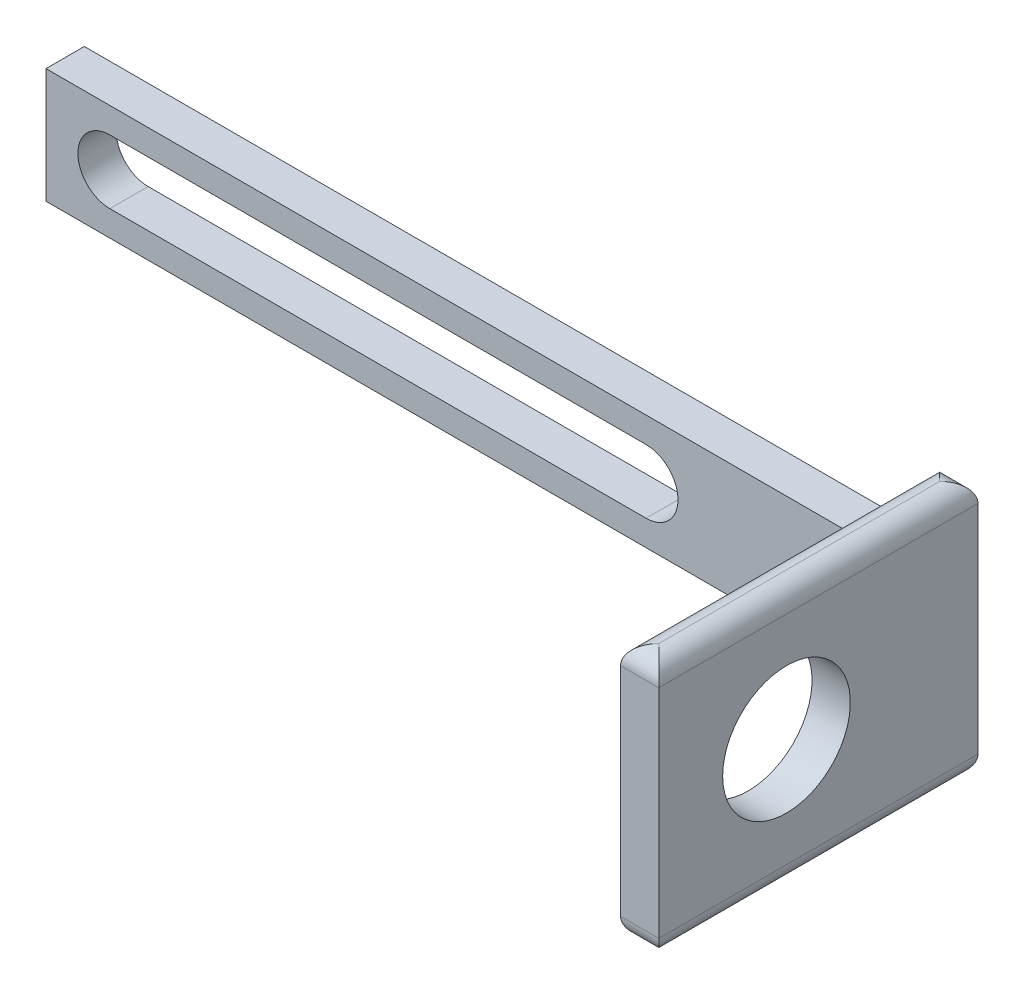
ISO-10303-21;
HEADER;
FILE_DESCRIPTION(('STEP AP214'),'2;1');
FILE_NAME('part.step','',(''),(''),'','','');
FILE_SCHEMA(('AUTOMOTIVE_DESIGN { 1 0 10303 214 1 1 1 1 }'));
ENDSEC;
DATA;
#1=APPLICATION_CONTEXT('core data for automotive mechanical design processes');
#2=APPLICATION_PROTOCOL_DEFINITION('international standard','automotive_design',2000,#1);
#3=PRODUCT_CONTEXT('',#1,'mechanical');
#4=PRODUCT('Part','Part','',(#3));
#5=PRODUCT_RELATED_PRODUCT_CATEGORY('part','',(#4));
#6=PRODUCT_DEFINITION_FORMATION('','',#4);
#7=PRODUCT_DEFINITION_CONTEXT('part definition',#1,'design');
#8=PRODUCT_DEFINITION('design','',#6,#7);
#9=PRODUCT_DEFINITION_SHAPE('','',#8);
#10=(LENGTH_UNIT() NAMED_UNIT(*) SI_UNIT(.MILLI.,.METRE.));
#11=(NAMED_UNIT(*) PLANE_ANGLE_UNIT() SI_UNIT($,.RADIAN.));
#12=(NAMED_UNIT(*) SI_UNIT($,.STERADIAN.) SOLID_ANGLE_UNIT());
#13=UNCERTAINTY_MEASURE_WITH_UNIT(LENGTH_MEASURE(1.E-05),#10,'distance_accuracy_value','');
#14=(GEOMETRIC_REPRESENTATION_CONTEXT(3) GLOBAL_UNCERTAINTY_ASSIGNED_CONTEXT((#13)) GLOBAL_UNIT_ASSIGNED_CONTEXT((#10,
#11,#12)) REPRESENTATION_CONTEXT('',''));
#15=CARTESIAN_POINT('',(0.,0.,0.));
#16=DIRECTION('',(0.,0.,1.));
#17=DIRECTION('',(1.,0.,0.));
#18=AXIS2_PLACEMENT_3D('',#15,#16,#17);
#19=CARTESIAN_POINT('',(35.,-4.5,3.));
#20=DIRECTION('',(0.,0.,1.));
#21=DIRECTION('',(1.,0.,0.));
#22=AXIS2_PLACEMENT_3D('',#19,#20,#21);
#23=PLANE('',#22);
#24=CARTESIAN_POINT('',(12.0000000000001,0.,3.));
#25=DIRECTION('',(0.,0.,1.));
#26=DIRECTION('',(1.,0.,0.));
#27=AXIS2_PLACEMENT_3D('',#24,#25,#26);
#28=CIRCLE('',#27,2.5);
#29=CARTESIAN_POINT('',(12.0000000000001,-2.5,3.));
#30=VERTEX_POINT('',#29);
#31=CARTESIAN_POINT('',(12.0000000000001,2.5,3.));
#32=VERTEX_POINT('',#31);
#33=EDGE_CURVE('E219',#30,#32,#28,.T.);
#34=ORIENTED_EDGE('',*,*,#33,.F.);
#35=DIRECTION('',(1.,0.,0.));
#36=VECTOR('',#35,1.);
#37=CARTESIAN_POINT('',(12.0000000000001,-2.5,3.));
#38=LINE('',#37,#36);
#39=CARTESIAN_POINT('',(-30.,-2.5,3.));
#40=VERTEX_POINT('',#39);
#41=EDGE_CURVE('E203',#40,#30,#38,.T.);
#42=ORIENTED_EDGE('',*,*,#41,.F.);
#43=CARTESIAN_POINT('',(-30.,0.,3.));
#44=DIRECTION('',(0.,0.,1.));
#45=DIRECTION('',(1.,0.,0.));
#46=AXIS2_PLACEMENT_3D('',#43,#44,#45);
#47=CIRCLE('',#46,2.5);
#48=CARTESIAN_POINT('',(-30.,2.5,3.));
#49=VERTEX_POINT('',#48);
#50=EDGE_CURVE('E213',#49,#40,#47,.T.);
#51=ORIENTED_EDGE('',*,*,#50,.F.);
#52=DIRECTION('',(-1.,0.,0.));
#53=VECTOR('',#52,1.);
#54=CARTESIAN_POINT('',(12.0000000000001,2.5,3.));
#55=LINE('',#54,#53);
#56=EDGE_CURVE('E216',#32,#49,#55,.T.);
#57=ORIENTED_EDGE('',*,*,#56,.F.);
#58=EDGE_LOOP('',(#34,#42,#51,#57));
#59=FACE_BOUND('',#58,.T.);
#60=DIRECTION('',(1.,0.,0.));
#61=VECTOR('',#60,1.);
#62=CARTESIAN_POINT('',(-35.,-4.5,3.));
#63=LINE('',#62,#61);
#64=CARTESIAN_POINT('',(-35.,-4.5,3.));
#65=VERTEX_POINT('',#64);
#66=CARTESIAN_POINT('',(30.0000000000001,-4.5,3.));
#67=VERTEX_POINT('',#66);
#68=EDGE_CURVE('E159',#65,#67,#63,.T.);
#69=ORIENTED_EDGE('',*,*,#68,.T.);
#70=DIRECTION('',(0.,1.,0.));
#71=VECTOR('',#70,1.);
#72=CARTESIAN_POINT('',(30.0000000000001,-4.5,3.));
#73=LINE('',#72,#71);
#74=CARTESIAN_POINT('',(30.0000000000001,4.5,3.));
#75=VERTEX_POINT('',#74);
#76=EDGE_CURVE('E150',#67,#75,#73,.T.);
#77=ORIENTED_EDGE('',*,*,#76,.T.);
#78=DIRECTION('',(-1.,0.,0.));
#79=VECTOR('',#78,1.);
#80=CARTESIAN_POINT('',(-35.,4.5,3.));
#81=LINE('',#80,#79);
#82=CARTESIAN_POINT('',(-35.,4.5,3.));
#83=VERTEX_POINT('',#82);
#84=EDGE_CURVE('E163',#75,#83,#81,.T.);
#85=ORIENTED_EDGE('',*,*,#84,.T.);
#86=DIRECTION('',(0.,-1.,0.));
#87=VECTOR('',#86,1.);
#88=CARTESIAN_POINT('',(-35.,4.5,3.));
#89=LINE('',#88,#87);
#90=EDGE_CURVE('E175',#83,#65,#89,.T.);
#91=ORIENTED_EDGE('',*,*,#90,.T.);
#92=EDGE_LOOP('',(#69,#77,#85,#91));
#93=FACE_BOUND('',#92,.T.);
#94=ADVANCED_FACE('F33',(#59,#93),#23,.T.);
#95=CARTESIAN_POINT('',(-35.,4.5,3.));
#96=DIRECTION('',(0.,-1.,0.));
#97=DIRECTION('',(0.,0.,-1.));
#98=AXIS2_PLACEMENT_3D('',#95,#96,#97);
#99=PLANE('',#98);
#100=ORIENTED_EDGE('',*,*,#84,.F.);
#101=DIRECTION('',(0.,0.,1.));
#102=VECTOR('',#101,1.);
#103=CARTESIAN_POINT('',(30.0000000000001,4.5,0.));
#104=LINE('',#103,#102);
#105=CARTESIAN_POINT('',(30.0000000000001,4.5,0.));
#106=VERTEX_POINT('',#105);
#107=EDGE_CURVE('E135',#75,#106,#104,.F.);
#108=ORIENTED_EDGE('',*,*,#107,.T.);
#109=DIRECTION('',(-1.,0.,0.));
#110=VECTOR('',#109,1.);
#111=CARTESIAN_POINT('',(-35.,4.5,0.));
#112=LINE('',#111,#110);
#113=CARTESIAN_POINT('',(-35.,4.5,0.));
#114=VERTEX_POINT('',#113);
#115=EDGE_CURVE('E167',#106,#114,#112,.T.);
#116=ORIENTED_EDGE('',*,*,#115,.T.);
#117=DIRECTION('',(0.,0.,-1.));
#118=VECTOR('',#117,1.);
#119=CARTESIAN_POINT('',(-35.,4.5,3.));
#120=LINE('',#119,#118);
#121=EDGE_CURVE('E153',#83,#114,#120,.T.);
#122=ORIENTED_EDGE('',*,*,#121,.F.);
#123=EDGE_LOOP('',(#100,#108,#116,#122));
#124=FACE_BOUND('',#123,.T.);
#125=ADVANCED_FACE('F328',(#124),#99,.F.);
#126=CARTESIAN_POINT('',(-35.,-4.5,3.));
#127=DIRECTION('',(0.,1.,0.));
#128=DIRECTION('',(0.,0.,1.));
#129=AXIS2_PLACEMENT_3D('',#126,#127,#128);
#130=PLANE('',#129);
#131=DIRECTION('',(1.,0.,0.));
#132=VECTOR('',#131,1.);
#133=CARTESIAN_POINT('',(-35.,-4.5,0.));
#134=LINE('',#133,#132);
#135=CARTESIAN_POINT('',(-35.,-4.5,0.));
#136=VERTEX_POINT('',#135);
#137=CARTESIAN_POINT('',(30.0000000000001,-4.5,0.));
#138=VERTEX_POINT('',#137);
#139=EDGE_CURVE('E160',#136,#138,#134,.T.);
#140=ORIENTED_EDGE('',*,*,#139,.T.);
#141=DIRECTION('',(0.,0.,-1.));
#142=VECTOR('',#141,1.);
#143=CARTESIAN_POINT('',(30.0000000000001,-4.5,5.));
#144=LINE('',#143,#142);
#145=EDGE_CURVE('E138',#138,#67,#144,.F.);
#146=ORIENTED_EDGE('',*,*,#145,.T.);
#147=ORIENTED_EDGE('',*,*,#68,.F.);
#148=DIRECTION('',(0.,0.,-1.));
#149=VECTOR('',#148,1.);
#150=CARTESIAN_POINT('',(-35.,-4.5,3.));
#151=LINE('',#150,#149);
#152=EDGE_CURVE('E156',#65,#136,#151,.T.);
#153=ORIENTED_EDGE('',*,*,#152,.T.);
#154=EDGE_LOOP('',(#140,#146,#147,#153));
#155=FACE_BOUND('',#154,.T.);
#156=ADVANCED_FACE('F319',(#155),#130,.F.);
#157=CARTESIAN_POINT('',(35.,4.5,3.));
#158=DIRECTION('',(-1.,0.,0.));
#159=DIRECTION('',(0.,0.,1.));
#160=AXIS2_PLACEMENT_3D('',#157,#158,#159);
#161=PLANE('',#160);
#162=CARTESIAN_POINT('',(35.,0.,15.));
#163=DIRECTION('',(-1.,0.,0.));
#164=DIRECTION('',(0.,0.,1.));
#165=AXIS2_PLACEMENT_3D('',#162,#163,#164);
#166=CIRCLE('',#165,5.);
#167=CARTESIAN_POINT('',(35.,0.,20.));
#168=VERTEX_POINT('',#167);
#169=EDGE_CURVE('E189',#168,#168,#166,.F.);
#170=ORIENTED_EDGE('',*,*,#169,.F.);
#171=EDGE_LOOP('',(#170));
#172=FACE_BOUND('',#171,.T.);
#173=DIRECTION('',(0.,1.,0.));
#174=VECTOR('',#173,1.);
#175=CARTESIAN_POINT('',(35.0000000000001,-10.,25.));
#176=LINE('',#175,#174);
#177=CARTESIAN_POINT('',(35.0000000000001,-8.5,25.));
#178=VERTEX_POINT('',#177);
#179=CARTESIAN_POINT('',(35.0000000000001,8.5,25.));
#180=VERTEX_POINT('',#179);
#181=EDGE_CURVE('E186',#178,#180,#176,.T.);
#182=ORIENTED_EDGE('',*,*,#181,.F.);
#183=DIRECTION('',(0.,0.,-1.));
#184=VECTOR('',#183,1.);
#185=CARTESIAN_POINT('',(35.,-8.5,3.));
#186=LINE('',#185,#184);
#187=CARTESIAN_POINT('',(35.,-8.5,0.));
#188=VERTEX_POINT('',#187);
#189=EDGE_CURVE('E110',#178,#188,#186,.T.);
#190=ORIENTED_EDGE('',*,*,#189,.T.);
#191=DIRECTION('',(0.,1.,0.));
#192=VECTOR('',#191,1.);
#193=CARTESIAN_POINT('',(35.,4.5,0.));
#194=LINE('',#193,#192);
#195=CARTESIAN_POINT('',(35.,8.5,0.));
#196=VERTEX_POINT('',#195);
#197=EDGE_CURVE('E170',#188,#196,#194,.T.);
#198=ORIENTED_EDGE('',*,*,#197,.T.);
#199=DIRECTION('',(0.,0.,-1.));
#200=VECTOR('',#199,1.);
#201=CARTESIAN_POINT('',(35.,8.5,3.));
#202=LINE('',#201,#200);
#203=EDGE_CURVE('E78',#196,#180,#202,.F.);
#204=ORIENTED_EDGE('',*,*,#203,.T.);
#205=EDGE_LOOP('',(#182,#190,#198,#204));
#206=FACE_BOUND('',#205,.T.);
#207=ADVANCED_FACE('F345',(#172,#206),#161,.F.);
#208=CARTESIAN_POINT('',(-35.,4.5,3.));
#209=DIRECTION('',(1.,0.,0.));
#210=DIRECTION('',(0.,0.,-1.));
#211=AXIS2_PLACEMENT_3D('',#208,#209,#210);
#212=PLANE('',#211);
#213=DIRECTION('',(0.,-1.,0.));
#214=VECTOR('',#213,1.);
#215=CARTESIAN_POINT('',(-35.,4.5,0.));
#216=LINE('',#215,#214);
#217=EDGE_CURVE('E164',#114,#136,#216,.T.);
#218=ORIENTED_EDGE('',*,*,#217,.T.);
#219=ORIENTED_EDGE('',*,*,#152,.F.);
#220=ORIENTED_EDGE('',*,*,#90,.F.);
#221=ORIENTED_EDGE('',*,*,#121,.T.);
#222=EDGE_LOOP('',(#218,#219,#220,#221));
#223=FACE_BOUND('',#222,.T.);
#224=ADVANCED_FACE('F324',(#223),#212,.F.);
#225=CARTESIAN_POINT('',(35.,-4.5,0.));
#226=DIRECTION('',(0.,0.,1.));
#227=DIRECTION('',(1.,0.,0.));
#228=AXIS2_PLACEMENT_3D('',#225,#226,#227);
#229=PLANE('',#228);
#230=DIRECTION('',(-1.,0.,0.));
#231=VECTOR('',#230,1.);
#232=CARTESIAN_POINT('',(12.0000000000001,-2.5,0.));
#233=LINE('',#232,#231);
#234=CARTESIAN_POINT('',(12.0000000000001,-2.5,0.));
#235=VERTEX_POINT('',#234);
#236=CARTESIAN_POINT('',(-30.,-2.5,0.));
#237=VERTEX_POINT('',#236);
#238=EDGE_CURVE('E225',#235,#237,#233,.T.);
#239=ORIENTED_EDGE('',*,*,#238,.F.);
#240=CARTESIAN_POINT('',(12.0000000000001,0.,0.));
#241=DIRECTION('',(0.,0.,1.));
#242=DIRECTION('',(1.,0.,0.));
#243=AXIS2_PLACEMENT_3D('',#240,#241,#242);
#244=CIRCLE('',#243,2.5);
#245=CARTESIAN_POINT('',(12.0000000000001,2.5,0.));
#246=VERTEX_POINT('',#245);
#247=EDGE_CURVE('E222',#246,#235,#244,.F.);
#248=ORIENTED_EDGE('',*,*,#247,.F.);
#249=DIRECTION('',(1.,0.,0.));
#250=VECTOR('',#249,1.);
#251=CARTESIAN_POINT('',(12.0000000000001,2.5,0.));
#252=LINE('',#251,#250);
#253=CARTESIAN_POINT('',(-30.,2.5,0.));
#254=VERTEX_POINT('',#253);
#255=EDGE_CURVE('E195',#254,#246,#252,.T.);
#256=ORIENTED_EDGE('',*,*,#255,.F.);
#257=CARTESIAN_POINT('',(-30.,0.,0.));
#258=DIRECTION('',(0.,0.,1.));
#259=DIRECTION('',(1.,0.,0.));
#260=AXIS2_PLACEMENT_3D('',#257,#258,#259);
#261=CIRCLE('',#260,2.5);
#262=EDGE_CURVE('E96',#237,#254,#261,.F.);
#263=ORIENTED_EDGE('',*,*,#262,.F.);
#264=EDGE_LOOP('',(#239,#248,#256,#263));
#265=FACE_BOUND('',#264,.T.);
#266=DIRECTION('',(0.,-1.,0.));
#267=VECTOR('',#266,1.);
#268=CARTESIAN_POINT('',(32.0000000000001,-10.,0.));
#269=LINE('',#268,#267);
#270=CARTESIAN_POINT('',(32.0000000000001,8.5,0.));
#271=VERTEX_POINT('',#270);
#272=CARTESIAN_POINT('',(32.0000000000001,6.5,0.));
#273=VERTEX_POINT('',#272);
#274=EDGE_CURVE('E172',#271,#273,#269,.T.);
#275=ORIENTED_EDGE('',*,*,#274,.F.);
#276=DIRECTION('',(-1.,0.,0.));
#277=VECTOR('',#276,1.);
#278=CARTESIAN_POINT('',(35.,8.5,0.));
#279=LINE('',#278,#277);
#280=EDGE_CURVE('E52',#271,#196,#279,.F.);
#281=ORIENTED_EDGE('',*,*,#280,.T.);
#282=ORIENTED_EDGE('',*,*,#197,.F.);
#283=DIRECTION('',(1.,0.,0.));
#284=VECTOR('',#283,1.);
#285=CARTESIAN_POINT('',(35.,-8.5,0.));
#286=LINE('',#285,#284);
#287=CARTESIAN_POINT('',(32.0000000000001,-8.5,0.));
#288=VERTEX_POINT('',#287);
#289=EDGE_CURVE('E114',#188,#288,#286,.F.);
#290=ORIENTED_EDGE('',*,*,#289,.T.);
#291=CARTESIAN_POINT('',(32.0000000000001,-6.5,0.));
#292=VERTEX_POINT('',#291);
#293=EDGE_CURVE('E182',#292,#288,#269,.T.);
#294=ORIENTED_EDGE('',*,*,#293,.F.);
#295=CARTESIAN_POINT('',(30.0000000000001,-6.5,0.));
#296=DIRECTION('',(0.,0.,1.));
#297=DIRECTION('',(1.,0.,0.));
#298=AXIS2_PLACEMENT_3D('',#295,#296,#297);
#299=CIRCLE('',#298,2.);
#300=EDGE_CURVE('E132',#292,#138,#299,.T.);
#301=ORIENTED_EDGE('',*,*,#300,.T.);
#302=ORIENTED_EDGE('',*,*,#139,.F.);
#303=ORIENTED_EDGE('',*,*,#217,.F.);
#304=ORIENTED_EDGE('',*,*,#115,.F.);
#305=CARTESIAN_POINT('',(30.0000000000001,6.5,0.));
#306=DIRECTION('',(0.,0.,1.));
#307=DIRECTION('',(1.,0.,0.));
#308=AXIS2_PLACEMENT_3D('',#305,#306,#307);
#309=CIRCLE('',#308,2.);
#310=EDGE_CURVE('E123',#106,#273,#309,.T.);
#311=ORIENTED_EDGE('',*,*,#310,.T.);
#312=EDGE_LOOP('',(#275,#281,#282,#290,#294,#301,#302,#303,#304,#311));
#313=FACE_BOUND('',#312,.T.);
#314=ADVANCED_FACE('F248',(#265,#313),#229,.F.);
#315=CARTESIAN_POINT('',(32.0000000000001,-10.,3.));
#316=DIRECTION('',(1.,0.,0.));
#317=DIRECTION('',(0.,0.,-1.));
#318=AXIS2_PLACEMENT_3D('',#315,#316,#317);
#319=PLANE('',#318);
#320=CARTESIAN_POINT('',(32.0000000000001,0.,15.));
#321=DIRECTION('',(-1.,0.,0.));
#322=DIRECTION('',(0.,0.,1.));
#323=AXIS2_PLACEMENT_3D('',#320,#321,#322);
#324=CIRCLE('',#323,5.);
#325=CARTESIAN_POINT('',(32.0000000000001,0.,20.));
#326=VERTEX_POINT('',#325);
#327=EDGE_CURVE('E192',#326,#326,#324,.T.);
#328=ORIENTED_EDGE('',*,*,#327,.F.);
#329=EDGE_LOOP('',(#328));
#330=FACE_BOUND('',#329,.T.);
#331=ORIENTED_EDGE('',*,*,#293,.T.);
#332=DIRECTION('',(0.,0.,-1.));
#333=VECTOR('',#332,1.);
#334=CARTESIAN_POINT('',(32.0000000000001,-8.5,3.));
#335=LINE('',#334,#333);
#336=CARTESIAN_POINT('',(32.0000000000001,-8.5,25.));
#337=VERTEX_POINT('',#336);
#338=EDGE_CURVE('E12',#288,#337,#335,.F.);
#339=ORIENTED_EDGE('',*,*,#338,.T.);
#340=DIRECTION('',(0.,-1.,0.));
#341=VECTOR('',#340,1.);
#342=CARTESIAN_POINT('',(32.0000000000001,-10.,25.));
#343=LINE('',#342,#341);
#344=CARTESIAN_POINT('',(32.0000000000001,8.5,25.));
#345=VERTEX_POINT('',#344);
#346=EDGE_CURVE('E183',#345,#337,#343,.T.);
#347=ORIENTED_EDGE('',*,*,#346,.F.);
#348=DIRECTION('',(0.,0.,-1.));
#349=VECTOR('',#348,1.);
#350=CARTESIAN_POINT('',(32.0000000000001,8.5,3.));
#351=LINE('',#350,#349);
#352=EDGE_CURVE('E43',#345,#271,#351,.T.);
#353=ORIENTED_EDGE('',*,*,#352,.T.);
#354=ORIENTED_EDGE('',*,*,#274,.T.);
#355=DIRECTION('',(0.,0.,1.));
#356=VECTOR('',#355,1.);
#357=CARTESIAN_POINT('',(32.0000000000001,6.5,5.));
#358=LINE('',#357,#356);
#359=CARTESIAN_POINT('',(32.0000000000001,6.5,5.));
#360=VERTEX_POINT('',#359);
#361=EDGE_CURVE('E144',#273,#360,#358,.T.);
#362=ORIENTED_EDGE('',*,*,#361,.T.);
#363=DIRECTION('',(0.,1.,0.));
#364=VECTOR('',#363,1.);
#365=CARTESIAN_POINT('',(32.0000000000001,-10.,5.));
#366=LINE('',#365,#364);
#367=CARTESIAN_POINT('',(32.0000000000001,-6.5,5.));
#368=VERTEX_POINT('',#367);
#369=EDGE_CURVE('E147',#360,#368,#366,.F.);
#370=ORIENTED_EDGE('',*,*,#369,.T.);
#371=DIRECTION('',(0.,0.,-1.));
#372=VECTOR('',#371,1.);
#373=CARTESIAN_POINT('',(32.0000000000001,-6.5,0.));
#374=LINE('',#373,#372);
#375=EDGE_CURVE('E141',#368,#292,#374,.T.);
#376=ORIENTED_EDGE('',*,*,#375,.T.);
#377=EDGE_LOOP('',(#331,#339,#347,#353,#354,#362,#370,#376));
#378=FACE_BOUND('',#377,.T.);
#379=ADVANCED_FACE('F299',(#330,#378),#319,.F.);
#380=CARTESIAN_POINT('',(35.0000000000001,-10.,25.));
#381=DIRECTION('',(0.,0.,1.));
#382=DIRECTION('',(1.,0.,0.));
#383=AXIS2_PLACEMENT_3D('',#380,#381,#382);
#384=PLANE('',#383);
#385=ORIENTED_EDGE('',*,*,#346,.T.);
#386=DIRECTION('',(1.,0.,0.));
#387=VECTOR('',#386,1.);
#388=CARTESIAN_POINT('',(35.0000000000001,-8.5,25.));
#389=LINE('',#388,#387);
#390=EDGE_CURVE('E117',#337,#178,#389,.T.);
#391=ORIENTED_EDGE('',*,*,#390,.T.);
#392=ORIENTED_EDGE('',*,*,#181,.T.);
#393=DIRECTION('',(-1.,0.,0.));
#394=VECTOR('',#393,1.);
#395=CARTESIAN_POINT('',(32.0000000000001,8.5,25.));
#396=LINE('',#395,#394);
#397=EDGE_CURVE('E120',#180,#345,#396,.T.);
#398=ORIENTED_EDGE('',*,*,#397,.T.);
#399=EDGE_LOOP('',(#385,#391,#392,#398));
#400=FACE_BOUND('',#399,.T.);
#401=ADVANCED_FACE('F354',(#400),#384,.T.);
#402=CARTESIAN_POINT('',(30.0000000000001,-4.5,5.));
#403=DIRECTION('',(0.,1.,0.));
#404=DIRECTION('',(0.,0.,1.));
#405=AXIS2_PLACEMENT_3D('',#402,#403,#404);
#406=CYLINDRICAL_SURFACE('',#405,2.);
#407=ORIENTED_EDGE('',*,*,#76,.F.);
#408=CARTESIAN_POINT('',(30.0000000000001,-6.5,5.));
#409=DIRECTION('',(0.,0.707106781186547,0.707106781186547));
#410=DIRECTION('',(0.,0.707106781186547,-0.707106781186547));
#411=AXIS2_PLACEMENT_3D('',#408,#409,#410);
#412=ELLIPSE('',#411,2.82842712474619,2.);
#413=EDGE_CURVE('E129',#67,#368,#412,.F.);
#414=ORIENTED_EDGE('',*,*,#413,.T.);
#415=ORIENTED_EDGE('',*,*,#369,.F.);
#416=CARTESIAN_POINT('',(30.0000000000001,6.5,5.));
#417=DIRECTION('',(0.,0.707106781186547,-0.707106781186547));
#418=DIRECTION('',(0.,0.707106781186547,0.707106781186547));
#419=AXIS2_PLACEMENT_3D('',#416,#417,#418);
#420=ELLIPSE('',#419,2.82842712474619,2.);
#421=EDGE_CURVE('E126',#360,#75,#420,.T.);
#422=ORIENTED_EDGE('',*,*,#421,.T.);
#423=EDGE_LOOP('',(#407,#414,#415,#422));
#424=FACE_BOUND('',#423,.T.);
#425=ADVANCED_FACE('F313',(#424),#406,.F.);
#426=CARTESIAN_POINT('',(35.0010000000001,0.,15.));
#427=DIRECTION('',(-1.,0.,0.));
#428=DIRECTION('',(0.,0.,1.));
#429=AXIS2_PLACEMENT_3D('',#426,#427,#428);
#430=CYLINDRICAL_SURFACE('',#429,5.);
#431=ORIENTED_EDGE('',*,*,#327,.T.);
#432=EDGE_LOOP('',(#431));
#433=FACE_BOUND('',#432,.T.);
#434=ORIENTED_EDGE('',*,*,#169,.T.);
#435=EDGE_LOOP('',(#434));
#436=FACE_BOUND('',#435,.T.);
#437=ADVANCED_FACE('F353',(#433,#436),#430,.F.);
#438=CARTESIAN_POINT('',(12.0000000000001,0.,-0.00100000000000013));
#439=DIRECTION('',(0.,0.,1.));
#440=DIRECTION('',(1.,0.,0.));
#441=AXIS2_PLACEMENT_3D('',#438,#439,#440);
#442=CYLINDRICAL_SURFACE('',#441,2.5);
#443=ORIENTED_EDGE('',*,*,#247,.T.);
#444=DIRECTION('',(0.,0.,1.));
#445=VECTOR('',#444,1.);
#446=CARTESIAN_POINT('',(12.0000000000001,-2.5,-0.00100000000000013));
#447=LINE('',#446,#445);
#448=EDGE_CURVE('E198',#235,#30,#447,.T.);
#449=ORIENTED_EDGE('',*,*,#448,.T.);
#450=ORIENTED_EDGE('',*,*,#33,.T.);
#451=DIRECTION('',(0.,0.,1.));
#452=VECTOR('',#451,1.);
#453=CARTESIAN_POINT('',(12.0000000000001,2.5,-0.00100000000000013));
#454=LINE('',#453,#452);
#455=EDGE_CURVE('E199',#246,#32,#454,.T.);
#456=ORIENTED_EDGE('',*,*,#455,.F.);
#457=EDGE_LOOP('',(#443,#449,#450,#456));
#458=FACE_BOUND('',#457,.T.);
#459=ADVANCED_FACE('F253',(#458),#442,.F.);
#460=CARTESIAN_POINT('',(12.0000000000001,-2.5,-0.00100000000000013));
#461=DIRECTION('',(0.,-1.,0.));
#462=DIRECTION('',(0.,0.,-1.));
#463=AXIS2_PLACEMENT_3D('',#460,#461,#462);
#464=PLANE('',#463);
#465=ORIENTED_EDGE('',*,*,#238,.T.);
#466=DIRECTION('',(0.,0.,1.));
#467=VECTOR('',#466,1.);
#468=CARTESIAN_POINT('',(-30.,-2.5,-0.00100000000000013));
#469=LINE('',#468,#467);
#470=EDGE_CURVE('E206',#237,#40,#469,.T.);
#471=ORIENTED_EDGE('',*,*,#470,.T.);
#472=ORIENTED_EDGE('',*,*,#41,.T.);
#473=ORIENTED_EDGE('',*,*,#448,.F.);
#474=EDGE_LOOP('',(#465,#471,#472,#473));
#475=FACE_BOUND('',#474,.T.);
#476=ADVANCED_FACE('F425',(#475),#464,.F.);
#477=CARTESIAN_POINT('',(-30.,0.,-0.00100000000000013));
#478=DIRECTION('',(0.,0.,1.));
#479=DIRECTION('',(1.,0.,0.));
#480=AXIS2_PLACEMENT_3D('',#477,#478,#479);
#481=CYLINDRICAL_SURFACE('',#480,2.5);
#482=ORIENTED_EDGE('',*,*,#262,.T.);
#483=DIRECTION('',(0.,0.,1.));
#484=VECTOR('',#483,1.);
#485=CARTESIAN_POINT('',(-30.,2.5,-0.00100000000000013));
#486=LINE('',#485,#484);
#487=EDGE_CURVE('E202',#254,#49,#486,.T.);
#488=ORIENTED_EDGE('',*,*,#487,.T.);
#489=ORIENTED_EDGE('',*,*,#50,.T.);
#490=ORIENTED_EDGE('',*,*,#470,.F.);
#491=EDGE_LOOP('',(#482,#488,#489,#490));
#492=FACE_BOUND('',#491,.T.);
#493=ADVANCED_FACE('F234',(#492),#481,.F.);
#494=CARTESIAN_POINT('',(12.0000000000001,2.5,-0.00100000000000013));
#495=DIRECTION('',(0.,1.,0.));
#496=DIRECTION('',(0.,0.,1.));
#497=AXIS2_PLACEMENT_3D('',#494,#495,#496);
#498=PLANE('',#497);
#499=ORIENTED_EDGE('',*,*,#255,.T.);
#500=ORIENTED_EDGE('',*,*,#455,.T.);
#501=ORIENTED_EDGE('',*,*,#56,.T.);
#502=ORIENTED_EDGE('',*,*,#487,.F.);
#503=EDGE_LOOP('',(#499,#500,#501,#502));
#504=FACE_BOUND('',#503,.T.);
#505=ADVANCED_FACE('F244',(#504),#498,.F.);
#506=CARTESIAN_POINT('',(30.0000000000001,-6.5,3.));
#507=DIRECTION('',(0.,0.,1.));
#508=DIRECTION('',(1.,0.,0.));
#509=AXIS2_PLACEMENT_3D('',#506,#507,#508);
#510=CYLINDRICAL_SURFACE('',#509,2.);
#511=ORIENTED_EDGE('',*,*,#413,.F.);
#512=ORIENTED_EDGE('',*,*,#145,.F.);
#513=ORIENTED_EDGE('',*,*,#300,.F.);
#514=ORIENTED_EDGE('',*,*,#375,.F.);
#515=EDGE_LOOP('',(#511,#512,#513,#514));
#516=FACE_BOUND('',#515,.T.);
#517=ADVANCED_FACE('F316',(#516),#510,.F.);
#518=CARTESIAN_POINT('',(30.0000000000001,6.5,3.));
#519=DIRECTION('',(0.,0.,-1.));
#520=DIRECTION('',(-1.,0.,0.));
#521=AXIS2_PLACEMENT_3D('',#518,#519,#520);
#522=CYLINDRICAL_SURFACE('',#521,2.);
#523=ORIENTED_EDGE('',*,*,#310,.F.);
#524=ORIENTED_EDGE('',*,*,#107,.F.);
#525=ORIENTED_EDGE('',*,*,#421,.F.);
#526=ORIENTED_EDGE('',*,*,#361,.F.);
#527=EDGE_LOOP('',(#523,#524,#525,#526));
#528=FACE_BOUND('',#527,.T.);
#529=ADVANCED_FACE('F307',(#528),#522,.F.);
#530=CARTESIAN_POINT('',(32.0000000000001,-8.5,1.5));
#531=DIRECTION('',(1.,0.,0.));
#532=DIRECTION('',(0.,0.,-1.));
#533=AXIS2_PLACEMENT_3D('',#530,#531,#532);
#534=CYLINDRICAL_SURFACE('',#533,1.5);
#535=CARTESIAN_POINT('',(33.5000000000001,-8.5,1.5));
#536=DIRECTION('',(0.707106781186547,0.,-0.707106781186547));
#537=DIRECTION('',(-0.707106781186547,0.,-0.707106781186547));
#538=AXIS2_PLACEMENT_3D('',#535,#536,#537);
#539=ELLIPSE('',#538,2.12132034355964,1.5);
#540=CARTESIAN_POINT('',(33.5,-10.,1.5));
#541=VERTEX_POINT('',#540);
#542=EDGE_CURVE('E94',#288,#541,#539,.F.);
#543=ORIENTED_EDGE('',*,*,#542,.F.);
#544=ORIENTED_EDGE('',*,*,#289,.F.);
#545=CARTESIAN_POINT('',(33.5,-8.5,1.5));
#546=DIRECTION('',(-0.707106781186547,0.,-0.707106781186547));
#547=DIRECTION('',(0.707106781186547,0.,-0.707106781186547));
#548=AXIS2_PLACEMENT_3D('',#545,#546,#547);
#549=ELLIPSE('',#548,2.12132034355964,1.5);
#550=EDGE_CURVE('E97',#541,#188,#549,.F.);
#551=ORIENTED_EDGE('',*,*,#550,.F.);
#552=EDGE_LOOP('',(#543,#544,#551));
#553=FACE_BOUND('',#552,.T.);
#554=ADVANCED_FACE('F359',(#553),#534,.T.);
#555=CARTESIAN_POINT('',(33.5000000000001,-8.5,25.));
#556=DIRECTION('',(0.,0.,-1.));
#557=DIRECTION('',(-1.,0.,0.));
#558=AXIS2_PLACEMENT_3D('',#555,#556,#557);
#559=CYLINDRICAL_SURFACE('',#558,1.5);
#560=ORIENTED_EDGE('',*,*,#338,.F.);
#561=ORIENTED_EDGE('',*,*,#542,.T.);
#562=DIRECTION('',(0.,0.,-1.));
#563=VECTOR('',#562,1.);
#564=CARTESIAN_POINT('',(33.5000000000001,-10.,25.));
#565=LINE('',#564,#563);
#566=CARTESIAN_POINT('',(33.5000000000001,-10.,23.5));
#567=VERTEX_POINT('',#566);
#568=EDGE_CURVE('E100',#567,#541,#565,.T.);
#569=ORIENTED_EDGE('',*,*,#568,.F.);
#570=CARTESIAN_POINT('',(33.5000000000001,-8.5,23.5));
#571=DIRECTION('',(-0.707106781186547,0.,-0.707106781186547));
#572=DIRECTION('',(0.707106781186547,0.,-0.707106781186547));
#573=AXIS2_PLACEMENT_3D('',#570,#571,#572);
#574=ELLIPSE('',#573,2.12132034355964,1.5);
#575=EDGE_CURVE('E103',#337,#567,#574,.F.);
#576=ORIENTED_EDGE('',*,*,#575,.F.);
#577=EDGE_LOOP('',(#560,#561,#569,#576));
#578=FACE_BOUND('',#577,.T.);
#579=ADVANCED_FACE('F367',(#578),#559,.T.);
#580=CARTESIAN_POINT('',(33.5,-8.5,3.));
#581=DIRECTION('',(0.,0.,-1.));
#582=DIRECTION('',(-1.,0.,0.));
#583=AXIS2_PLACEMENT_3D('',#580,#581,#582);
#584=CYLINDRICAL_SURFACE('',#583,1.5);
#585=ORIENTED_EDGE('',*,*,#550,.T.);
#586=ORIENTED_EDGE('',*,*,#189,.F.);
#587=CARTESIAN_POINT('',(33.5,-8.5,23.5));
#588=DIRECTION('',(0.707106781186547,0.,-0.707106781186547));
#589=DIRECTION('',(-0.707106781186547,0.,-0.707106781186547));
#590=AXIS2_PLACEMENT_3D('',#587,#588,#589);
#591=ELLIPSE('',#590,2.12132034355964,1.5);
#592=EDGE_CURVE('E80',#567,#178,#591,.F.);
#593=ORIENTED_EDGE('',*,*,#592,.F.);
#594=ORIENTED_EDGE('',*,*,#568,.T.);
#595=EDGE_LOOP('',(#585,#586,#593,#594));
#596=FACE_BOUND('',#595,.T.);
#597=ADVANCED_FACE('F363',(#596),#584,.T.);
#598=CARTESIAN_POINT('',(35.0000000000001,-8.5,23.5));
#599=DIRECTION('',(-1.,0.,0.));
#600=DIRECTION('',(0.,0.,1.));
#601=AXIS2_PLACEMENT_3D('',#598,#599,#600);
#602=CYLINDRICAL_SURFACE('',#601,1.5);
#603=ORIENTED_EDGE('',*,*,#390,.F.);
#604=ORIENTED_EDGE('',*,*,#575,.T.);
#605=ORIENTED_EDGE('',*,*,#592,.T.);
#606=EDGE_LOOP('',(#603,#604,#605));
#607=FACE_BOUND('',#606,.T.);
#608=ADVANCED_FACE('F360',(#607),#602,.T.);
#609=CARTESIAN_POINT('',(32.0000000000001,8.5,1.5));
#610=DIRECTION('',(-1.,0.,0.));
#611=DIRECTION('',(0.,0.,1.));
#612=AXIS2_PLACEMENT_3D('',#609,#610,#611);
#613=CYLINDRICAL_SURFACE('',#612,1.5);
#614=CARTESIAN_POINT('',(33.5,8.5,1.5));
#615=DIRECTION('',(-0.707106781186547,0.,-0.707106781186547));
#616=DIRECTION('',(0.707106781186547,0.,-0.707106781186547));
#617=AXIS2_PLACEMENT_3D('',#614,#615,#616);
#618=ELLIPSE('',#617,2.12132034355964,1.5);
#619=CARTESIAN_POINT('',(33.5000000000001,10.,1.5));
#620=VERTEX_POINT('',#619);
#621=EDGE_CURVE('E37',#196,#620,#618,.F.);
#622=ORIENTED_EDGE('',*,*,#621,.F.);
#623=ORIENTED_EDGE('',*,*,#280,.F.);
#624=CARTESIAN_POINT('',(33.5000000000001,8.5,1.5));
#625=DIRECTION('',(0.707106781186547,0.,-0.707106781186547));
#626=DIRECTION('',(-0.707106781186547,0.,-0.707106781186547));
#627=AXIS2_PLACEMENT_3D('',#624,#625,#626);
#628=ELLIPSE('',#627,2.12132034355964,1.5);
#629=EDGE_CURVE('E81',#620,#271,#628,.F.);
#630=ORIENTED_EDGE('',*,*,#629,.F.);
#631=EDGE_LOOP('',(#622,#623,#630));
#632=FACE_BOUND('',#631,.T.);
#633=ADVANCED_FACE('F35',(#632),#613,.T.);
#634=CARTESIAN_POINT('',(33.5,8.5,25.));
#635=DIRECTION('',(0.,0.,-1.));
#636=DIRECTION('',(-1.,0.,0.));
#637=AXIS2_PLACEMENT_3D('',#634,#635,#636);
#638=CYLINDRICAL_SURFACE('',#637,1.5);
#639=ORIENTED_EDGE('',*,*,#203,.F.);
#640=ORIENTED_EDGE('',*,*,#621,.T.);
#641=DIRECTION('',(0.,0.,-1.));
#642=VECTOR('',#641,1.);
#643=CARTESIAN_POINT('',(33.5,10.,25.));
#644=LINE('',#643,#642);
#645=CARTESIAN_POINT('',(33.5,10.,23.5));
#646=VERTEX_POINT('',#645);
#647=EDGE_CURVE('E71',#646,#620,#644,.T.);
#648=ORIENTED_EDGE('',*,*,#647,.F.);
#649=CARTESIAN_POINT('',(33.5,8.5,23.5));
#650=DIRECTION('',(0.707106781186547,0.,-0.707106781186547));
#651=DIRECTION('',(-0.707106781186547,0.,-0.707106781186547));
#652=AXIS2_PLACEMENT_3D('',#649,#650,#651);
#653=ELLIPSE('',#652,2.12132034355964,1.5);
#654=EDGE_CURVE('E89',#180,#646,#653,.F.);
#655=ORIENTED_EDGE('',*,*,#654,.F.);
#656=EDGE_LOOP('',(#639,#640,#648,#655));
#657=FACE_BOUND('',#656,.T.);
#658=ADVANCED_FACE('F76',(#657),#638,.T.);
#659=CARTESIAN_POINT('',(33.5000000000001,8.5,3.));
#660=DIRECTION('',(0.,0.,-1.));
#661=DIRECTION('',(-1.,0.,0.));
#662=AXIS2_PLACEMENT_3D('',#659,#660,#661);
#663=CYLINDRICAL_SURFACE('',#662,1.5);
#664=ORIENTED_EDGE('',*,*,#629,.T.);
#665=ORIENTED_EDGE('',*,*,#352,.F.);
#666=CARTESIAN_POINT('',(33.5000000000001,8.5,23.5));
#667=DIRECTION('',(-0.707106781186547,0.,-0.707106781186547));
#668=DIRECTION('',(0.707106781186547,0.,-0.707106781186547));
#669=AXIS2_PLACEMENT_3D('',#666,#667,#668);
#670=ELLIPSE('',#669,2.12132034355964,1.5);
#671=EDGE_CURVE('E88',#646,#345,#670,.F.);
#672=ORIENTED_EDGE('',*,*,#671,.F.);
#673=ORIENTED_EDGE('',*,*,#647,.T.);
#674=EDGE_LOOP('',(#664,#665,#672,#673));
#675=FACE_BOUND('',#674,.T.);
#676=ADVANCED_FACE('F86',(#675),#663,.T.);
#677=CARTESIAN_POINT('',(35.0000000000001,8.5,23.5));
#678=DIRECTION('',(1.,0.,0.));
#679=DIRECTION('',(0.,0.,-1.));
#680=AXIS2_PLACEMENT_3D('',#677,#678,#679);
#681=CYLINDRICAL_SURFACE('',#680,1.5);
#682=ORIENTED_EDGE('',*,*,#397,.F.);
#683=ORIENTED_EDGE('',*,*,#654,.T.);
#684=ORIENTED_EDGE('',*,*,#671,.T.);
#685=EDGE_LOOP('',(#682,#683,#684));
#686=FACE_BOUND('',#685,.T.);
#687=ADVANCED_FACE('F375',(#686),#681,.T.);
#688=CLOSED_SHELL('',(#94,#125,#156,#207,#224,#314,#379,#401,#425,#437,#459,#476,#493,#505,#517,
#529,#554,#579,#597,#608,#633,#658,#676,#687));
#689=MANIFOLD_SOLID_BREP('B2',#688);
#690=ADVANCED_BREP_SHAPE_REPRESENTATION('',(#18,#689),#14);
#691=SHAPE_DEFINITION_REPRESENTATION(#9,#690);
ENDSEC;
END-ISO-10303-21;
